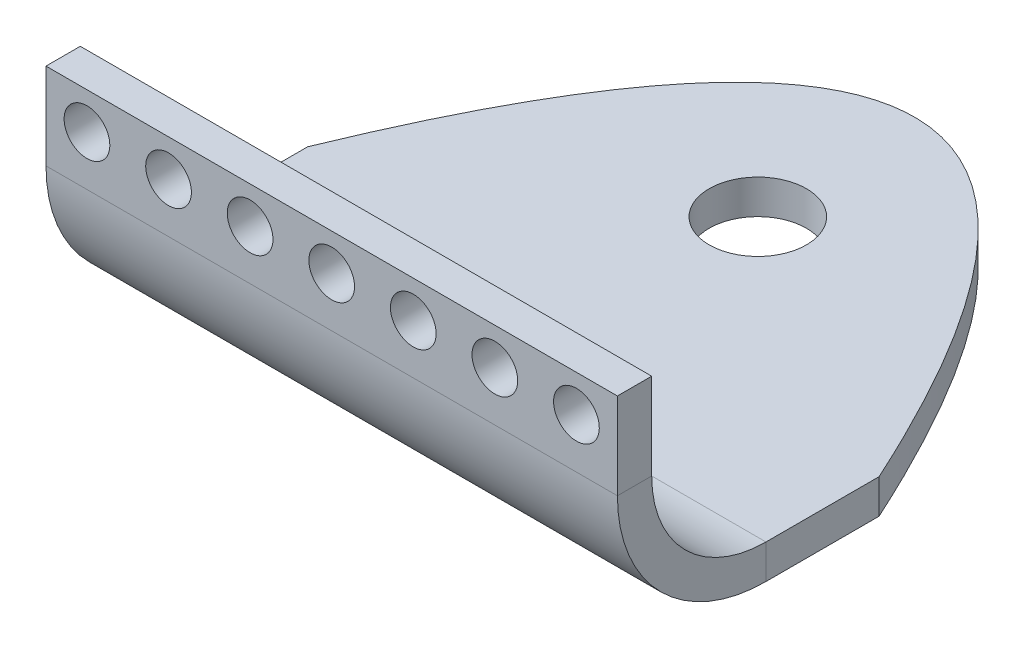
ISO-10303-21;
HEADER;
FILE_DESCRIPTION(('STEP AP214'),'2;1');
FILE_NAME('part.step','',(''),(''),'','','');
FILE_SCHEMA(('AUTOMOTIVE_DESIGN { 1 0 10303 214 1 1 1 1 }'));
ENDSEC;
DATA;
#1=APPLICATION_CONTEXT('core data for automotive mechanical design processes');
#2=APPLICATION_PROTOCOL_DEFINITION('international standard','automotive_design',2000,#1);
#3=PRODUCT_CONTEXT('',#1,'mechanical');
#4=PRODUCT('Part','Part','',(#3));
#5=PRODUCT_RELATED_PRODUCT_CATEGORY('part','',(#4));
#6=PRODUCT_DEFINITION_FORMATION('','',#4);
#7=PRODUCT_DEFINITION_CONTEXT('part definition',#1,'design');
#8=PRODUCT_DEFINITION('design','',#6,#7);
#9=PRODUCT_DEFINITION_SHAPE('','',#8);
#10=(LENGTH_UNIT() NAMED_UNIT(*) SI_UNIT(.MILLI.,.METRE.));
#11=(NAMED_UNIT(*) PLANE_ANGLE_UNIT() SI_UNIT($,.RADIAN.));
#12=(NAMED_UNIT(*) SI_UNIT($,.STERADIAN.) SOLID_ANGLE_UNIT());
#13=UNCERTAINTY_MEASURE_WITH_UNIT(LENGTH_MEASURE(1.E-05),#10,'distance_accuracy_value','');
#14=(GEOMETRIC_REPRESENTATION_CONTEXT(3) GLOBAL_UNCERTAINTY_ASSIGNED_CONTEXT((#13)) GLOBAL_UNIT_ASSIGNED_CONTEXT((#10,
#11,#12)) REPRESENTATION_CONTEXT('',''));
#15=CARTESIAN_POINT('',(0.,0.,0.));
#16=DIRECTION('',(0.,0.,1.));
#17=DIRECTION('',(1.,0.,0.));
#18=AXIS2_PLACEMENT_3D('',#15,#16,#17);
#19=CARTESIAN_POINT('',(45.9876855318448,13.7142143072193,-10.2783720653607));
#20=DIRECTION('',(-1.,0.,0.));
#21=DIRECTION('',(0.,1.,0.));
#22=AXIS2_PLACEMENT_3D('',#19,#20,#21);
#23=PLANE('',#22);
#24=DIRECTION('',(0.,1.,0.));
#25=VECTOR('',#24,1.);
#26=CARTESIAN_POINT('',(45.9876855318448,13.7142143072193,-7.27837206536066));
#27=LINE('',#26,#25);
#28=CARTESIAN_POINT('',(45.9876855318448,11.5,-7.27837206536065));
#29=VERTEX_POINT('',#28);
#30=CARTESIAN_POINT('',(45.9876855318448,19.0637258855321,-7.27837206536068));
#31=VERTEX_POINT('',#30);
#32=EDGE_CURVE('E171',#29,#31,#27,.T.);
#33=ORIENTED_EDGE('',*,*,#32,.F.);
#34=DIRECTION('',(0.,0.,-1.));
#35=VECTOR('',#34,1.);
#36=CARTESIAN_POINT('',(45.9876855318448,11.5,-10.2783720653607));
#37=LINE('',#36,#35);
#38=CARTESIAN_POINT('',(45.9876855318448,11.5,-10.2783720653607));
#39=VERTEX_POINT('',#38);
#40=EDGE_CURVE('E138',#29,#39,#37,.T.);
#41=ORIENTED_EDGE('',*,*,#40,.T.);
#42=DIRECTION('',(0.,1.,0.));
#43=VECTOR('',#42,1.);
#44=CARTESIAN_POINT('',(45.9876855318448,13.7142143072193,-10.2783720653607));
#45=LINE('',#44,#43);
#46=CARTESIAN_POINT('',(45.9876855318448,19.0637258855321,-10.2783720653607));
#47=VERTEX_POINT('',#46);
#48=EDGE_CURVE('E77',#39,#47,#45,.T.);
#49=ORIENTED_EDGE('',*,*,#48,.T.);
#50=DIRECTION('',(0.,0.,-1.));
#51=VECTOR('',#50,1.);
#52=CARTESIAN_POINT('',(45.9876855318448,19.0637258855321,-10.2783720653607));
#53=LINE('',#52,#51);
#54=EDGE_CURVE('E175',#31,#47,#53,.T.);
#55=ORIENTED_EDGE('',*,*,#54,.F.);
#56=EDGE_LOOP('',(#33,#41,#49,#55));
#57=FACE_BOUND('',#56,.T.);
#58=ADVANCED_FACE('F51',(#57),#23,.F.);
#59=CARTESIAN_POINT('',(-4.01231446815521,13.7142143072193,-10.2783720653607));
#60=DIRECTION('',(-1.,0.,0.));
#61=DIRECTION('',(0.,1.,0.));
#62=AXIS2_PLACEMENT_3D('',#59,#60,#61);
#63=PLANE('',#62);
#64=DIRECTION('',(0.,1.,0.));
#65=VECTOR('',#64,1.);
#66=CARTESIAN_POINT('',(-4.01231446815521,13.7142143072193,-10.2783720653607));
#67=LINE('',#66,#65);
#68=CARTESIAN_POINT('',(-4.01231446815521,11.5,-10.2783720653607));
#69=VERTEX_POINT('',#68);
#70=CARTESIAN_POINT('',(-4.01231446815521,19.0637258855321,-10.2783720653607));
#71=VERTEX_POINT('',#70);
#72=EDGE_CURVE('E55',#69,#71,#67,.T.);
#73=ORIENTED_EDGE('',*,*,#72,.F.);
#74=DIRECTION('',(0.,0.,1.));
#75=VECTOR('',#74,1.);
#76=CARTESIAN_POINT('',(-4.01231446815521,11.5,-10.2783720653607));
#77=LINE('',#76,#75);
#78=CARTESIAN_POINT('',(-4.01231446815521,11.5,-7.27837206536065));
#79=VERTEX_POINT('',#78);
#80=EDGE_CURVE('E12',#69,#79,#77,.T.);
#81=ORIENTED_EDGE('',*,*,#80,.T.);
#82=DIRECTION('',(0.,1.,0.));
#83=VECTOR('',#82,1.);
#84=CARTESIAN_POINT('',(-4.01231446815521,13.7142143072193,-7.27837206536066));
#85=LINE('',#84,#83);
#86=CARTESIAN_POINT('',(-4.01231446815521,19.0637258855321,-7.27837206536068));
#87=VERTEX_POINT('',#86);
#88=EDGE_CURVE('E91',#79,#87,#85,.T.);
#89=ORIENTED_EDGE('',*,*,#88,.T.);
#90=DIRECTION('',(0.,0.,-1.));
#91=VECTOR('',#90,1.);
#92=CARTESIAN_POINT('',(-4.01231446815521,19.0637258855321,-10.2783720653607));
#93=LINE('',#92,#91);
#94=EDGE_CURVE('E166',#87,#71,#93,.T.);
#95=ORIENTED_EDGE('',*,*,#94,.T.);
#96=EDGE_LOOP('',(#73,#81,#89,#95));
#97=FACE_BOUND('',#96,.T.);
#98=ADVANCED_FACE('F53',(#97),#63,.T.);
#99=CARTESIAN_POINT('',(0.,13.7142143072193,-10.2783720653607));
#100=DIRECTION('',(0.,0.,-1.));
#101=DIRECTION('',(0.,1.,0.));
#102=AXIS2_PLACEMENT_3D('',#99,#100,#101);
#103=PLANE('',#102);
#104=CARTESIAN_POINT('',(42.4029749438783,15.8495718583174,-10.2783720653607));
#105=DIRECTION('',(0.,0.,-1.));
#106=DIRECTION('',(0.,1.,0.));
#107=AXIS2_PLACEMENT_3D('',#104,#105,#106);
#108=CIRCLE('',#107,2.);
#109=CARTESIAN_POINT('',(42.4029749438783,17.8495718583174,-10.2783720653607));
#110=VERTEX_POINT('',#109);
#111=EDGE_CURVE('E292',#110,#110,#108,.T.);
#112=ORIENTED_EDGE('',*,*,#111,.F.);
#113=EDGE_LOOP('',(#112));
#114=FACE_BOUND('',#113,.T.);
#115=CARTESIAN_POINT('',(35.2645451398671,15.8495718583174,-10.2783720653607));
#116=DIRECTION('',(0.,0.,-1.));
#117=DIRECTION('',(0.,1.,0.));
#118=AXIS2_PLACEMENT_3D('',#115,#116,#117);
#119=CIRCLE('',#118,2.);
#120=CARTESIAN_POINT('',(35.2645451398671,17.8495718583174,-10.2783720653607));
#121=VERTEX_POINT('',#120);
#122=EDGE_CURVE('E289',#121,#121,#119,.T.);
#123=ORIENTED_EDGE('',*,*,#122,.F.);
#124=EDGE_LOOP('',(#123));
#125=FACE_BOUND('',#124,.T.);
#126=CARTESIAN_POINT('',(28.126115335856,15.8495718583174,-10.2783720653607));
#127=DIRECTION('',(0.,0.,-1.));
#128=DIRECTION('',(0.,1.,0.));
#129=AXIS2_PLACEMENT_3D('',#126,#127,#128);
#130=CIRCLE('',#129,2.00000000000001);
#131=CARTESIAN_POINT('',(28.126115335856,17.8495718583174,-10.2783720653607));
#132=VERTEX_POINT('',#131);
#133=EDGE_CURVE('E285',#132,#132,#130,.T.);
#134=ORIENTED_EDGE('',*,*,#133,.F.);
#135=EDGE_LOOP('',(#134));
#136=FACE_BOUND('',#135,.T.);
#137=CARTESIAN_POINT('',(20.9876855318448,15.8495718583174,-10.2783720653607));
#138=DIRECTION('',(0.,0.,-1.));
#139=DIRECTION('',(0.,1.,0.));
#140=AXIS2_PLACEMENT_3D('',#137,#138,#139);
#141=CIRCLE('',#140,2.00000000000001);
#142=CARTESIAN_POINT('',(20.9876855318448,17.8495718583174,-10.2783720653607));
#143=VERTEX_POINT('',#142);
#144=EDGE_CURVE('E281',#143,#143,#141,.T.);
#145=ORIENTED_EDGE('',*,*,#144,.F.);
#146=EDGE_LOOP('',(#145));
#147=FACE_BOUND('',#146,.T.);
#148=CARTESIAN_POINT('',(13.8492557278336,15.8495718583174,-10.2783720653607));
#149=DIRECTION('',(0.,0.,-1.));
#150=DIRECTION('',(0.,1.,0.));
#151=AXIS2_PLACEMENT_3D('',#148,#149,#150);
#152=CIRCLE('',#151,2.);
#153=CARTESIAN_POINT('',(13.8492557278336,17.8495718583174,-10.2783720653607));
#154=VERTEX_POINT('',#153);
#155=EDGE_CURVE('E277',#154,#154,#152,.T.);
#156=ORIENTED_EDGE('',*,*,#155,.F.);
#157=EDGE_LOOP('',(#156));
#158=FACE_BOUND('',#157,.T.);
#159=CARTESIAN_POINT('',(6.71082592382243,15.8495718583174,-10.2783720653607));
#160=DIRECTION('',(0.,0.,-1.));
#161=DIRECTION('',(0.,1.,0.));
#162=AXIS2_PLACEMENT_3D('',#159,#160,#161);
#163=CIRCLE('',#162,2.);
#164=CARTESIAN_POINT('',(6.71082592382243,17.8495718583174,-10.2783720653607));
#165=VERTEX_POINT('',#164);
#166=EDGE_CURVE('E271',#165,#165,#163,.T.);
#167=ORIENTED_EDGE('',*,*,#166,.F.);
#168=EDGE_LOOP('',(#167));
#169=FACE_BOUND('',#168,.T.);
#170=CARTESIAN_POINT('',(-0.427603880188743,15.8495718583174,-10.2783720653607));
#171=DIRECTION('',(0.,0.,-1.));
#172=DIRECTION('',(0.,1.,0.));
#173=AXIS2_PLACEMENT_3D('',#170,#171,#172);
#174=CIRCLE('',#173,2.);
#175=CARTESIAN_POINT('',(-0.427603880188743,17.8495718583174,-10.2783720653607));
#176=VERTEX_POINT('',#175);
#177=EDGE_CURVE('E267',#176,#176,#174,.T.);
#178=ORIENTED_EDGE('',*,*,#177,.F.);
#179=EDGE_LOOP('',(#178));
#180=FACE_BOUND('',#179,.T.);
#181=ORIENTED_EDGE('',*,*,#48,.F.);
#182=DIRECTION('',(-1.,0.,0.));
#183=VECTOR('',#182,1.);
#184=CARTESIAN_POINT('',(0.,11.5,-10.2783720653607));
#185=LINE('',#184,#183);
#186=EDGE_CURVE('E178',#39,#69,#185,.T.);
#187=ORIENTED_EDGE('',*,*,#186,.T.);
#188=ORIENTED_EDGE('',*,*,#72,.T.);
#189=DIRECTION('',(1.,0.,0.));
#190=VECTOR('',#189,1.);
#191=CARTESIAN_POINT('',(0.,19.0637258855321,-10.2783720653607));
#192=LINE('',#191,#190);
#193=EDGE_CURVE('E170',#71,#47,#192,.T.);
#194=ORIENTED_EDGE('',*,*,#193,.T.);
#195=EDGE_LOOP('',(#181,#187,#188,#194));
#196=FACE_BOUND('',#195,.T.);
#197=ADVANCED_FACE('F183',(#114,#125,#136,#147,#158,#169,#180,#196),#103,.T.);
#198=CARTESIAN_POINT('',(0.,19.0637258855321,-10.2783720653607));
#199=DIRECTION('',(0.,1.,0.));
#200=DIRECTION('',(1.,0.,0.));
#201=AXIS2_PLACEMENT_3D('',#198,#199,#200);
#202=PLANE('',#201);
#203=ORIENTED_EDGE('',*,*,#94,.F.);
#204=DIRECTION('',(1.,0.,0.));
#205=VECTOR('',#204,1.);
#206=CARTESIAN_POINT('',(0.,19.0637258855321,-7.27837206536068));
#207=LINE('',#206,#205);
#208=EDGE_CURVE('E162',#87,#31,#207,.T.);
#209=ORIENTED_EDGE('',*,*,#208,.T.);
#210=ORIENTED_EDGE('',*,*,#54,.T.);
#211=ORIENTED_EDGE('',*,*,#193,.F.);
#212=EDGE_LOOP('',(#203,#209,#210,#211));
#213=FACE_BOUND('',#212,.T.);
#214=ADVANCED_FACE('F182',(#213),#202,.T.);
#215=CARTESIAN_POINT('',(0.,13.7142143072193,-7.27837206536066));
#216=DIRECTION('',(0.,0.,-1.));
#217=DIRECTION('',(0.,1.,0.));
#218=AXIS2_PLACEMENT_3D('',#215,#216,#217);
#219=PLANE('',#218);
#220=CARTESIAN_POINT('',(42.4029749438783,15.8495718583174,-7.27837206536064));
#221=DIRECTION('',(0.,0.,-1.));
#222=DIRECTION('',(0.,1.,0.));
#223=AXIS2_PLACEMENT_3D('',#220,#221,#222);
#224=CIRCLE('',#223,2.);
#225=CARTESIAN_POINT('',(42.4029749438783,17.8495718583174,-7.27837206536065));
#226=VERTEX_POINT('',#225);
#227=EDGE_CURVE('E196',#226,#226,#224,.T.);
#228=ORIENTED_EDGE('',*,*,#227,.T.);
#229=EDGE_LOOP('',(#228));
#230=FACE_BOUND('',#229,.T.);
#231=CARTESIAN_POINT('',(35.2645451398671,15.8495718583174,-7.27837206536064));
#232=DIRECTION('',(0.,0.,-1.));
#233=DIRECTION('',(0.,1.,0.));
#234=AXIS2_PLACEMENT_3D('',#231,#232,#233);
#235=CIRCLE('',#234,2.);
#236=CARTESIAN_POINT('',(35.2645451398671,17.8495718583174,-7.27837206536065));
#237=VERTEX_POINT('',#236);
#238=EDGE_CURVE('E247',#237,#237,#235,.T.);
#239=ORIENTED_EDGE('',*,*,#238,.T.);
#240=EDGE_LOOP('',(#239));
#241=FACE_BOUND('',#240,.T.);
#242=CARTESIAN_POINT('',(28.126115335856,15.8495718583174,-7.27837206536064));
#243=DIRECTION('',(0.,0.,-1.));
#244=DIRECTION('',(0.,1.,0.));
#245=AXIS2_PLACEMENT_3D('',#242,#243,#244);
#246=CIRCLE('',#245,2.00000000000001);
#247=CARTESIAN_POINT('',(28.126115335856,17.8495718583174,-7.27837206536065));
#248=VERTEX_POINT('',#247);
#249=EDGE_CURVE('E251',#248,#248,#246,.T.);
#250=ORIENTED_EDGE('',*,*,#249,.T.);
#251=EDGE_LOOP('',(#250));
#252=FACE_BOUND('',#251,.T.);
#253=CARTESIAN_POINT('',(20.9876855318448,15.8495718583174,-7.27837206536064));
#254=DIRECTION('',(0.,0.,-1.));
#255=DIRECTION('',(0.,1.,0.));
#256=AXIS2_PLACEMENT_3D('',#253,#254,#255);
#257=CIRCLE('',#256,2.00000000000001);
#258=CARTESIAN_POINT('',(20.9876855318448,17.8495718583174,-7.27837206536065));
#259=VERTEX_POINT('',#258);
#260=EDGE_CURVE('E255',#259,#259,#257,.T.);
#261=ORIENTED_EDGE('',*,*,#260,.T.);
#262=EDGE_LOOP('',(#261));
#263=FACE_BOUND('',#262,.T.);
#264=CARTESIAN_POINT('',(13.8492557278336,15.8495718583174,-7.27837206536064));
#265=DIRECTION('',(0.,0.,-1.));
#266=DIRECTION('',(0.,1.,0.));
#267=AXIS2_PLACEMENT_3D('',#264,#265,#266);
#268=CIRCLE('',#267,2.);
#269=CARTESIAN_POINT('',(13.8492557278336,17.8495718583174,-7.27837206536065));
#270=VERTEX_POINT('',#269);
#271=EDGE_CURVE('E259',#270,#270,#268,.T.);
#272=ORIENTED_EDGE('',*,*,#271,.T.);
#273=EDGE_LOOP('',(#272));
#274=FACE_BOUND('',#273,.T.);
#275=CARTESIAN_POINT('',(6.71082592382243,15.8495718583174,-7.27837206536064));
#276=DIRECTION('',(0.,0.,-1.));
#277=DIRECTION('',(0.,1.,0.));
#278=AXIS2_PLACEMENT_3D('',#275,#276,#277);
#279=CIRCLE('',#278,2.);
#280=CARTESIAN_POINT('',(6.71082592382243,17.8495718583174,-7.27837206536065));
#281=VERTEX_POINT('',#280);
#282=EDGE_CURVE('E263',#281,#281,#279,.T.);
#283=ORIENTED_EDGE('',*,*,#282,.T.);
#284=EDGE_LOOP('',(#283));
#285=FACE_BOUND('',#284,.T.);
#286=CARTESIAN_POINT('',(-0.427603880188743,15.8495718583174,-7.27837206536064));
#287=DIRECTION('',(0.,0.,-1.));
#288=DIRECTION('',(0.,1.,0.));
#289=AXIS2_PLACEMENT_3D('',#286,#287,#288);
#290=CIRCLE('',#289,2.);
#291=CARTESIAN_POINT('',(-0.427603880188743,17.8495718583174,-7.27837206536065));
#292=VERTEX_POINT('',#291);
#293=EDGE_CURVE('E193',#292,#292,#290,.T.);
#294=ORIENTED_EDGE('',*,*,#293,.T.);
#295=EDGE_LOOP('',(#294));
#296=FACE_BOUND('',#295,.T.);
#297=DIRECTION('',(-1.,0.,0.));
#298=VECTOR('',#297,1.);
#299=CARTESIAN_POINT('',(0.,11.5,-7.27837206536065));
#300=LINE('',#299,#298);
#301=EDGE_CURVE('E60',#29,#79,#300,.T.);
#302=ORIENTED_EDGE('',*,*,#301,.F.);
#303=ORIENTED_EDGE('',*,*,#32,.T.);
#304=ORIENTED_EDGE('',*,*,#208,.F.);
#305=ORIENTED_EDGE('',*,*,#88,.F.);
#306=EDGE_LOOP('',(#302,#303,#304,#305));
#307=FACE_BOUND('',#306,.T.);
#308=ADVANCED_FACE('F160',(#230,#241,#252,#263,#274,#285,#296,#307),#219,.F.);
#309=CARTESIAN_POINT('',(20.9876855318448,1.5,-44.5659150633774));
#310=DIRECTION('',(0.,1.,0.));
#311=DIRECTION('',(0.,0.,1.));
#312=AXIS2_PLACEMENT_3D('',#309,#310,#311);
#313=CYLINDRICAL_SURFACE('',#312,4.25836650770474);
#314=CARTESIAN_POINT('',(20.9876855318448,1.5,-44.5659150633774));
#315=DIRECTION('',(0.,1.,0.));
#316=DIRECTION('',(0.,0.,1.));
#317=AXIS2_PLACEMENT_3D('',#314,#315,#316);
#318=CIRCLE('',#317,4.25836650770474);
#319=CARTESIAN_POINT('',(20.9876855318448,1.5,-40.3075485556727));
#320=VERTEX_POINT('',#319);
#321=EDGE_CURVE('E590',#320,#320,#318,.T.);
#322=ORIENTED_EDGE('',*,*,#321,.T.);
#323=EDGE_LOOP('',(#322));
#324=FACE_BOUND('',#323,.T.);
#325=CARTESIAN_POINT('',(20.9876855318448,-1.5,-44.5659150633774));
#326=DIRECTION('',(0.,1.,0.));
#327=DIRECTION('',(0.,0.,1.));
#328=AXIS2_PLACEMENT_3D('',#325,#326,#327);
#329=CIRCLE('',#328,4.25836650770474);
#330=CARTESIAN_POINT('',(20.9876855318448,-1.5,-40.3075485556727));
#331=VERTEX_POINT('',#330);
#332=EDGE_CURVE('E593',#331,#331,#329,.T.);
#333=ORIENTED_EDGE('',*,*,#332,.F.);
#334=EDGE_LOOP('',(#333));
#335=FACE_BOUND('',#334,.T.);
#336=ADVANCED_FACE('F214',(#324,#335),#313,.F.);
#337=CARTESIAN_POINT('',(-4.01231446815521,1.5,-30.1736477592982));
#338=CARTESIAN_POINT('',(19.6190175334985,1.5,-87.7858212534566));
#339=CARTESIAN_POINT('',(45.9876855318448,1.5,-30.1736477592982));
#340=B_SPLINE_CURVE_WITH_KNOTS('',2,(#337,#338,#339),.UNSPECIFIED.,.F.,.F.,(3,3),(0.,1.),.UNSPECIFIED.);
#341=DIRECTION('',(0.,1.,0.));
#342=VECTOR('',#341,1.);
#343=SURFACE_OF_LINEAR_EXTRUSION('',#340,#342);
#344=DIRECTION('',(0.,1.,0.));
#345=VECTOR('',#344,1.);
#346=CARTESIAN_POINT('',(45.9876855318448,1.5,-30.1736477592982));
#347=LINE('',#346,#345);
#348=CARTESIAN_POINT('',(45.9876855318448,-1.5,-30.1736477592982));
#349=VERTEX_POINT('',#348);
#350=CARTESIAN_POINT('',(45.9876855318448,1.5,-30.1736477592982));
#351=VERTEX_POINT('',#350);
#352=EDGE_CURVE('E598',#349,#351,#347,.T.);
#353=ORIENTED_EDGE('',*,*,#352,.F.);
#354=CARTESIAN_POINT('',(-4.01231446815521,-1.5,-30.1736477592982));
#355=CARTESIAN_POINT('',(19.6190175334985,-1.5,-87.7858212534566));
#356=CARTESIAN_POINT('',(45.9876855318448,-1.5,-30.1736477592982));
#357=B_SPLINE_CURVE_WITH_KNOTS('',2,(#354,#355,#356),.UNSPECIFIED.,.F.,.F.,(3,3),(0.,1.),.UNSPECIFIED.);
#358=CARTESIAN_POINT('',(-4.01231446815521,-1.5,-30.1736477592982));
#359=VERTEX_POINT('',#358);
#360=EDGE_CURVE('E613',#359,#349,#357,.T.);
#361=ORIENTED_EDGE('',*,*,#360,.F.);
#362=DIRECTION('',(0.,1.,0.));
#363=VECTOR('',#362,1.);
#364=CARTESIAN_POINT('',(-4.01231446815521,1.5,-30.1736477592982));
#365=LINE('',#364,#363);
#366=CARTESIAN_POINT('',(-4.01231446815521,1.5,-30.1736477592982));
#367=VERTEX_POINT('',#366);
#368=EDGE_CURVE('E100',#359,#367,#365,.T.);
#369=ORIENTED_EDGE('',*,*,#368,.T.);
#370=EDGE_CURVE('E198',#367,#351,#340,.T.);
#371=ORIENTED_EDGE('',*,*,#370,.T.);
#372=EDGE_LOOP('',(#353,#361,#369,#371));
#373=FACE_BOUND('',#372,.T.);
#374=ADVANCED_FACE('F209',(#373),#343,.F.);
#375=CARTESIAN_POINT('',(0.,1.5,0.));
#376=DIRECTION('',(0.,1.,0.));
#377=DIRECTION('',(0.,0.,1.));
#378=AXIS2_PLACEMENT_3D('',#375,#376,#377);
#379=PLANE('',#378);
#380=DIRECTION('',(-1.,0.,0.));
#381=VECTOR('',#380,1.);
#382=CARTESIAN_POINT('',(0.,1.5,-20.2783720653607));
#383=LINE('',#382,#381);
#384=CARTESIAN_POINT('',(45.9876855318448,1.5,-20.2783720653607));
#385=VERTEX_POINT('',#384);
#386=CARTESIAN_POINT('',(-4.01231446815521,1.5,-20.2783720653607));
#387=VERTEX_POINT('',#386);
#388=EDGE_CURVE('E190',#385,#387,#383,.T.);
#389=ORIENTED_EDGE('',*,*,#388,.F.);
#390=DIRECTION('',(0.,0.,1.));
#391=VECTOR('',#390,1.);
#392=CARTESIAN_POINT('',(45.9876855318448,1.5,0.));
#393=LINE('',#392,#391);
#394=EDGE_CURVE('E131',#351,#385,#393,.T.);
#395=ORIENTED_EDGE('',*,*,#394,.F.);
#396=ORIENTED_EDGE('',*,*,#370,.F.);
#397=DIRECTION('',(0.,0.,1.));
#398=VECTOR('',#397,1.);
#399=CARTESIAN_POINT('',(-4.01231446815521,1.5,0.));
#400=LINE('',#399,#398);
#401=EDGE_CURVE('E123',#367,#387,#400,.T.);
#402=ORIENTED_EDGE('',*,*,#401,.T.);
#403=EDGE_LOOP('',(#389,#395,#396,#402));
#404=FACE_BOUND('',#403,.T.);
#405=ORIENTED_EDGE('',*,*,#321,.F.);
#406=EDGE_LOOP('',(#405));
#407=FACE_BOUND('',#406,.T.);
#408=ADVANCED_FACE('F213',(#404,#407),#379,.T.);
#409=CARTESIAN_POINT('',(45.9876855318448,1.5,0.));
#410=DIRECTION('',(-1.,0.,0.));
#411=DIRECTION('',(0.,0.,1.));
#412=AXIS2_PLACEMENT_3D('',#409,#410,#411);
#413=PLANE('',#412);
#414=DIRECTION('',(0.,1.,0.));
#415=VECTOR('',#414,1.);
#416=CARTESIAN_POINT('',(45.9876855318448,1.5,-20.2783720653607));
#417=LINE('',#416,#415);
#418=CARTESIAN_POINT('',(45.9876855318448,-1.5,-20.2783720653607));
#419=VERTEX_POINT('',#418);
#420=EDGE_CURVE('E188',#419,#385,#417,.T.);
#421=ORIENTED_EDGE('',*,*,#420,.F.);
#422=DIRECTION('',(0.,0.,1.));
#423=VECTOR('',#422,1.);
#424=CARTESIAN_POINT('',(45.9876855318448,-1.5,0.));
#425=LINE('',#424,#423);
#426=EDGE_CURVE('E594',#349,#419,#425,.T.);
#427=ORIENTED_EDGE('',*,*,#426,.F.);
#428=ORIENTED_EDGE('',*,*,#352,.T.);
#429=ORIENTED_EDGE('',*,*,#394,.T.);
#430=EDGE_LOOP('',(#421,#427,#428,#429));
#431=FACE_BOUND('',#430,.T.);
#432=ADVANCED_FACE('F219',(#431),#413,.F.);
#433=CARTESIAN_POINT('',(0.,-1.5,0.));
#434=DIRECTION('',(0.,1.,0.));
#435=DIRECTION('',(0.,0.,1.));
#436=AXIS2_PLACEMENT_3D('',#433,#434,#435);
#437=PLANE('',#436);
#438=ORIENTED_EDGE('',*,*,#332,.T.);
#439=EDGE_LOOP('',(#438));
#440=FACE_BOUND('',#439,.T.);
#441=ORIENTED_EDGE('',*,*,#426,.T.);
#442=DIRECTION('',(-1.,0.,0.));
#443=VECTOR('',#442,1.);
#444=CARTESIAN_POINT('',(0.,-1.5,-20.2783720653607));
#445=LINE('',#444,#443);
#446=CARTESIAN_POINT('',(-4.01231446815521,-1.5,-20.2783720653607));
#447=VERTEX_POINT('',#446);
#448=EDGE_CURVE('E596',#419,#447,#445,.T.);
#449=ORIENTED_EDGE('',*,*,#448,.T.);
#450=DIRECTION('',(0.,0.,1.));
#451=VECTOR('',#450,1.);
#452=CARTESIAN_POINT('',(-4.01231446815521,-1.5,0.));
#453=LINE('',#452,#451);
#454=EDGE_CURVE('E163',#359,#447,#453,.T.);
#455=ORIENTED_EDGE('',*,*,#454,.F.);
#456=ORIENTED_EDGE('',*,*,#360,.T.);
#457=EDGE_LOOP('',(#441,#449,#455,#456));
#458=FACE_BOUND('',#457,.T.);
#459=ADVANCED_FACE('F222',(#440,#458),#437,.F.);
#460=CARTESIAN_POINT('',(-4.01231446815521,1.5,0.));
#461=DIRECTION('',(-1.,0.,0.));
#462=DIRECTION('',(0.,0.,1.));
#463=AXIS2_PLACEMENT_3D('',#460,#461,#462);
#464=PLANE('',#463);
#465=DIRECTION('',(0.,-1.,0.));
#466=VECTOR('',#465,1.);
#467=CARTESIAN_POINT('',(-4.01231446815521,1.5,-20.2783720653607));
#468=LINE('',#467,#466);
#469=EDGE_CURVE('E156',#387,#447,#468,.T.);
#470=ORIENTED_EDGE('',*,*,#469,.F.);
#471=ORIENTED_EDGE('',*,*,#401,.F.);
#472=ORIENTED_EDGE('',*,*,#368,.F.);
#473=ORIENTED_EDGE('',*,*,#454,.T.);
#474=EDGE_LOOP('',(#470,#471,#472,#473));
#475=FACE_BOUND('',#474,.T.);
#476=ADVANCED_FACE('F225',(#475),#464,.T.);
#477=CARTESIAN_POINT('',(45.9876855318448,11.5,-20.2783720653607));
#478=DIRECTION('',(-1.,0.,0.));
#479=DIRECTION('',(0.,0.,1.));
#480=AXIS2_PLACEMENT_3D('',#477,#478,#479);
#481=PLANE('',#480);
#482=ORIENTED_EDGE('',*,*,#40,.F.);
#483=CARTESIAN_POINT('',(45.9876855318448,11.5,-20.2783720653607));
#484=DIRECTION('',(1.,0.,0.));
#485=DIRECTION('',(0.,0.,-1.));
#486=AXIS2_PLACEMENT_3D('',#483,#484,#485);
#487=CIRCLE('',#486,13.);
#488=EDGE_CURVE('E148',#29,#419,#487,.T.);
#489=ORIENTED_EDGE('',*,*,#488,.T.);
#490=ORIENTED_EDGE('',*,*,#420,.T.);
#491=CARTESIAN_POINT('',(45.9876855318448,11.5,-20.2783720653607));
#492=DIRECTION('',(1.,0.,0.));
#493=DIRECTION('',(0.,0.,1.));
#494=AXIS2_PLACEMENT_3D('',#491,#492,#493);
#495=CIRCLE('',#494,10.);
#496=EDGE_CURVE('E157',#39,#385,#495,.T.);
#497=ORIENTED_EDGE('',*,*,#496,.F.);
#498=EDGE_LOOP('',(#482,#489,#490,#497));
#499=FACE_BOUND('',#498,.T.);
#500=ADVANCED_FACE('F187',(#499),#481,.F.);
#501=CARTESIAN_POINT('',(-4.01231446815521,11.5,-20.2783720653607));
#502=DIRECTION('',(1.,0.,0.));
#503=DIRECTION('',(0.,0.,-1.));
#504=AXIS2_PLACEMENT_3D('',#501,#502,#503);
#505=PLANE('',#504);
#506=CARTESIAN_POINT('',(-4.01231446815521,11.5,-20.2783720653607));
#507=DIRECTION('',(1.,0.,0.));
#508=DIRECTION('',(0.,0.,-1.));
#509=AXIS2_PLACEMENT_3D('',#506,#507,#508);
#510=CIRCLE('',#509,13.);
#511=EDGE_CURVE('E147',#447,#79,#510,.F.);
#512=ORIENTED_EDGE('',*,*,#511,.T.);
#513=ORIENTED_EDGE('',*,*,#80,.F.);
#514=CARTESIAN_POINT('',(-4.01231446815521,11.5,-20.2783720653607));
#515=DIRECTION('',(-1.,0.,0.));
#516=DIRECTION('',(0.,0.,1.));
#517=AXIS2_PLACEMENT_3D('',#514,#515,#516);
#518=CIRCLE('',#517,10.);
#519=EDGE_CURVE('E68',#387,#69,#518,.T.);
#520=ORIENTED_EDGE('',*,*,#519,.F.);
#521=ORIENTED_EDGE('',*,*,#469,.T.);
#522=EDGE_LOOP('',(#512,#513,#520,#521));
#523=FACE_BOUND('',#522,.T.);
#524=ADVANCED_FACE('F154',(#523),#505,.F.);
#525=CARTESIAN_POINT('',(-32.2599791635296,11.5,-20.2783720653607));
#526=DIRECTION('',(1.,0.,0.));
#527=DIRECTION('',(0.,0.,-1.));
#528=AXIS2_PLACEMENT_3D('',#525,#526,#527);
#529=CYLINDRICAL_SURFACE('',#528,10.);
#530=ORIENTED_EDGE('',*,*,#388,.T.);
#531=ORIENTED_EDGE('',*,*,#519,.T.);
#532=ORIENTED_EDGE('',*,*,#186,.F.);
#533=ORIENTED_EDGE('',*,*,#496,.T.);
#534=EDGE_LOOP('',(#530,#531,#532,#533));
#535=FACE_BOUND('',#534,.T.);
#536=ADVANCED_FACE('F185',(#535),#529,.F.);
#537=CARTESIAN_POINT('',(-32.2599791635296,11.5,-20.2783720653607));
#538=DIRECTION('',(1.,0.,0.));
#539=DIRECTION('',(0.,0.,-1.));
#540=AXIS2_PLACEMENT_3D('',#537,#538,#539);
#541=CYLINDRICAL_SURFACE('',#540,13.);
#542=ORIENTED_EDGE('',*,*,#448,.F.);
#543=ORIENTED_EDGE('',*,*,#488,.F.);
#544=ORIENTED_EDGE('',*,*,#301,.T.);
#545=ORIENTED_EDGE('',*,*,#511,.F.);
#546=EDGE_LOOP('',(#542,#543,#544,#545));
#547=FACE_BOUND('',#546,.T.);
#548=ADVANCED_FACE('F146',(#547),#541,.T.);
#549=CARTESIAN_POINT('',(-0.427603880188743,15.8495718583174,-7.27837206536064));
#550=DIRECTION('',(0.,0.,-1.));
#551=DIRECTION('',(0.,1.,0.));
#552=AXIS2_PLACEMENT_3D('',#549,#550,#551);
#553=CYLINDRICAL_SURFACE('',#552,2.);
#554=ORIENTED_EDGE('',*,*,#293,.F.);
#555=EDGE_LOOP('',(#554));
#556=FACE_BOUND('',#555,.T.);
#557=ORIENTED_EDGE('',*,*,#177,.T.);
#558=EDGE_LOOP('',(#557));
#559=FACE_BOUND('',#558,.T.);
#560=ADVANCED_FACE('F313',(#556,#559),#553,.F.);
#561=CARTESIAN_POINT('',(6.71082592382243,15.8495718583174,-7.27837206536064));
#562=DIRECTION('',(0.,0.,-1.));
#563=DIRECTION('',(0.,1.,0.));
#564=AXIS2_PLACEMENT_3D('',#561,#562,#563);
#565=CYLINDRICAL_SURFACE('',#564,2.);
#566=ORIENTED_EDGE('',*,*,#282,.F.);
#567=EDGE_LOOP('',(#566));
#568=FACE_BOUND('',#567,.T.);
#569=ORIENTED_EDGE('',*,*,#166,.T.);
#570=EDGE_LOOP('',(#569));
#571=FACE_BOUND('',#570,.T.);
#572=ADVANCED_FACE('F310',(#568,#571),#565,.F.);
#573=CARTESIAN_POINT('',(13.8492557278336,15.8495718583174,-7.27837206536064));
#574=DIRECTION('',(0.,0.,-1.));
#575=DIRECTION('',(0.,1.,0.));
#576=AXIS2_PLACEMENT_3D('',#573,#574,#575);
#577=CYLINDRICAL_SURFACE('',#576,2.);
#578=ORIENTED_EDGE('',*,*,#271,.F.);
#579=EDGE_LOOP('',(#578));
#580=FACE_BOUND('',#579,.T.);
#581=ORIENTED_EDGE('',*,*,#155,.T.);
#582=EDGE_LOOP('',(#581));
#583=FACE_BOUND('',#582,.T.);
#584=ADVANCED_FACE('F312',(#580,#583),#577,.F.);
#585=CARTESIAN_POINT('',(20.9876855318448,15.8495718583174,-7.27837206536064));
#586=DIRECTION('',(0.,0.,-1.));
#587=DIRECTION('',(0.,1.,0.));
#588=AXIS2_PLACEMENT_3D('',#585,#586,#587);
#589=CYLINDRICAL_SURFACE('',#588,2.00000000000001);
#590=ORIENTED_EDGE('',*,*,#260,.F.);
#591=EDGE_LOOP('',(#590));
#592=FACE_BOUND('',#591,.T.);
#593=ORIENTED_EDGE('',*,*,#144,.T.);
#594=EDGE_LOOP('',(#593));
#595=FACE_BOUND('',#594,.T.);
#596=ADVANCED_FACE('F320',(#592,#595),#589,.F.);
#597=CARTESIAN_POINT('',(28.126115335856,15.8495718583174,-7.27837206536064));
#598=DIRECTION('',(0.,0.,-1.));
#599=DIRECTION('',(0.,1.,0.));
#600=AXIS2_PLACEMENT_3D('',#597,#598,#599);
#601=CYLINDRICAL_SURFACE('',#600,2.00000000000001);
#602=ORIENTED_EDGE('',*,*,#249,.F.);
#603=EDGE_LOOP('',(#602));
#604=FACE_BOUND('',#603,.T.);
#605=ORIENTED_EDGE('',*,*,#133,.T.);
#606=EDGE_LOOP('',(#605));
#607=FACE_BOUND('',#606,.T.);
#608=ADVANCED_FACE('F373',(#604,#607),#601,.F.);
#609=CARTESIAN_POINT('',(35.2645451398671,15.8495718583174,-7.27837206536064));
#610=DIRECTION('',(0.,0.,-1.));
#611=DIRECTION('',(0.,1.,0.));
#612=AXIS2_PLACEMENT_3D('',#609,#610,#611);
#613=CYLINDRICAL_SURFACE('',#612,2.);
#614=ORIENTED_EDGE('',*,*,#238,.F.);
#615=EDGE_LOOP('',(#614));
#616=FACE_BOUND('',#615,.T.);
#617=ORIENTED_EDGE('',*,*,#122,.T.);
#618=EDGE_LOOP('',(#617));
#619=FACE_BOUND('',#618,.T.);
#620=ADVANCED_FACE('F383',(#616,#619),#613,.F.);
#621=CARTESIAN_POINT('',(42.4029749438783,15.8495718583174,-7.27837206536064));
#622=DIRECTION('',(0.,0.,-1.));
#623=DIRECTION('',(0.,1.,0.));
#624=AXIS2_PLACEMENT_3D('',#621,#622,#623);
#625=CYLINDRICAL_SURFACE('',#624,2.);
#626=ORIENTED_EDGE('',*,*,#227,.F.);
#627=EDGE_LOOP('',(#626));
#628=FACE_BOUND('',#627,.T.);
#629=ORIENTED_EDGE('',*,*,#111,.T.);
#630=EDGE_LOOP('',(#629));
#631=FACE_BOUND('',#630,.T.);
#632=ADVANCED_FACE('F297',(#628,#631),#625,.F.);
#633=CLOSED_SHELL('',(#58,#98,#197,#214,#308,#336,#374,#408,#432,#459,#476,#500,#524,#536,#548,
#560,#572,#584,#596,#608,#620,#632));
#634=MANIFOLD_SOLID_BREP('B2',#633);
#635=ADVANCED_BREP_SHAPE_REPRESENTATION('',(#18,#634),#14);
#636=SHAPE_DEFINITION_REPRESENTATION(#9,#635);
ENDSEC;
END-ISO-10303-21;
